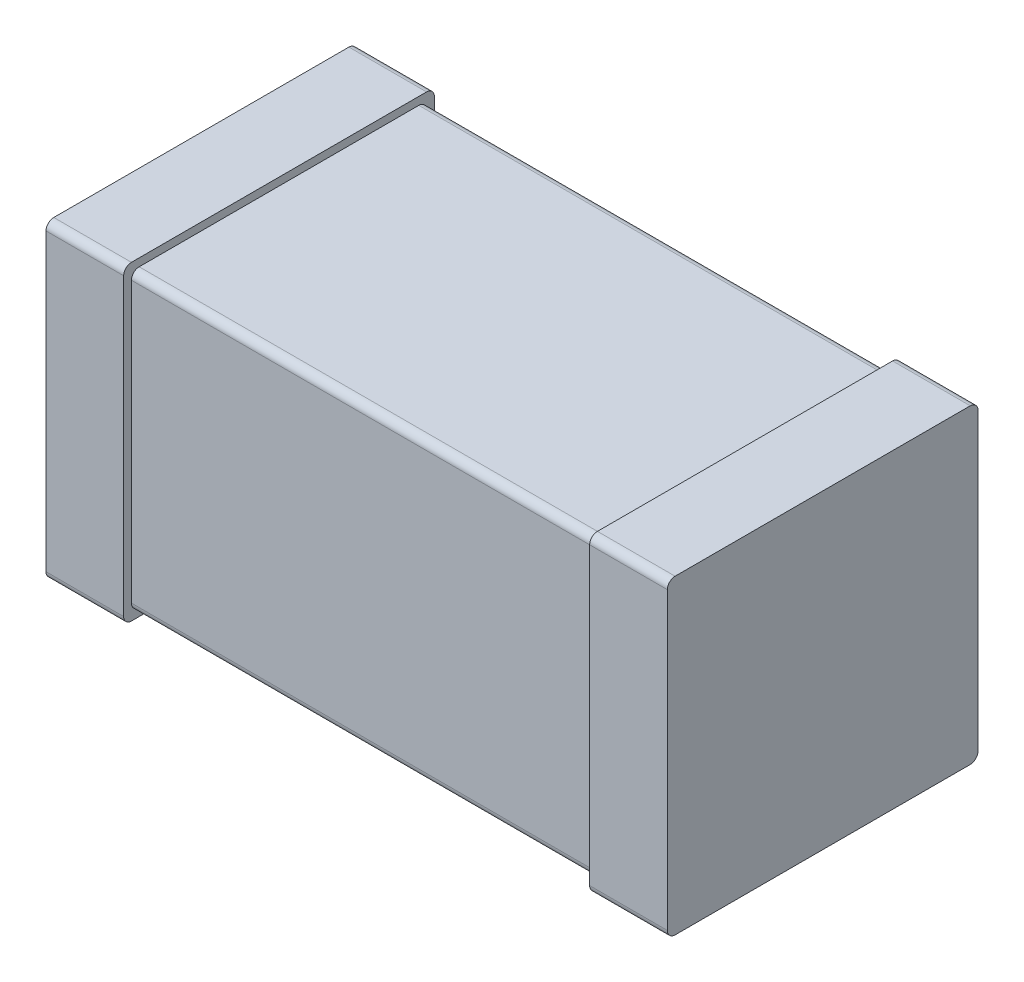
ISO-10303-21;
HEADER;
FILE_DESCRIPTION(('STEP AP214'),'2;1');
FILE_NAME('part.step','',(''),(''),'','','');
FILE_SCHEMA(('AUTOMOTIVE_DESIGN { 1 0 10303 214 1 1 1 1 }'));
ENDSEC;
DATA;
#1=APPLICATION_CONTEXT('core data for automotive mechanical design processes');
#2=APPLICATION_PROTOCOL_DEFINITION('international standard','automotive_design',2000,#1);
#3=PRODUCT_CONTEXT('',#1,'mechanical');
#4=PRODUCT('Part','Part','',(#3));
#5=PRODUCT_RELATED_PRODUCT_CATEGORY('part','',(#4));
#6=PRODUCT_DEFINITION_FORMATION('','',#4);
#7=PRODUCT_DEFINITION_CONTEXT('part definition',#1,'design');
#8=PRODUCT_DEFINITION('design','',#6,#7);
#9=PRODUCT_DEFINITION_SHAPE('','',#8);
#10=(LENGTH_UNIT() NAMED_UNIT(*) SI_UNIT(.MILLI.,.METRE.));
#11=(NAMED_UNIT(*) PLANE_ANGLE_UNIT() SI_UNIT($,.RADIAN.));
#12=(NAMED_UNIT(*) SI_UNIT($,.STERADIAN.) SOLID_ANGLE_UNIT());
#13=UNCERTAINTY_MEASURE_WITH_UNIT(LENGTH_MEASURE(1.E-05),#10,'distance_accuracy_value','');
#14=(GEOMETRIC_REPRESENTATION_CONTEXT(3) GLOBAL_UNCERTAINTY_ASSIGNED_CONTEXT((#13)) GLOBAL_UNIT_ASSIGNED_CONTEXT((#10,
#11,#12)) REPRESENTATION_CONTEXT('',''));
#15=CARTESIAN_POINT('',(0.,0.,0.));
#16=DIRECTION('',(0.,0.,1.));
#17=DIRECTION('',(1.,0.,0.));
#18=AXIS2_PLACEMENT_3D('',#15,#16,#17);
#19=CARTESIAN_POINT('',(-1.6,-0.8,0.));
#20=DIRECTION('',(1.,0.,0.));
#21=DIRECTION('',(0.,1.,0.));
#22=AXIS2_PLACEMENT_3D('',#19,#20,#21);
#23=PLANE('',#22);
#24=CARTESIAN_POINT('',(-1.6,-0.76,1.56));
#25=DIRECTION('',(-1.,0.,0.));
#26=DIRECTION('',(0.,0.,1.));
#27=AXIS2_PLACEMENT_3D('',#24,#25,#26);
#28=CIRCLE('',#27,0.04);
#29=CARTESIAN_POINT('',(-1.6,-0.8,1.56));
#30=VERTEX_POINT('',#29);
#31=CARTESIAN_POINT('',(-1.6,-0.76,1.6));
#32=VERTEX_POINT('',#31);
#33=EDGE_CURVE('E11',#30,#32,#28,.T.);
#34=ORIENTED_EDGE('',*,*,#33,.T.);
#35=DIRECTION('',(0.,1.,0.));
#36=VECTOR('',#35,1.);
#37=CARTESIAN_POINT('',(-1.6,-0.8,1.6));
#38=LINE('',#37,#36);
#39=CARTESIAN_POINT('',(-1.6,0.76,1.6));
#40=VERTEX_POINT('',#39);
#41=EDGE_CURVE('E27',#32,#40,#38,.T.);
#42=ORIENTED_EDGE('',*,*,#41,.T.);
#43=CARTESIAN_POINT('',(-1.6,0.76,1.56));
#44=DIRECTION('',(1.,0.,0.));
#45=DIRECTION('',(0.,0.,1.));
#46=AXIS2_PLACEMENT_3D('',#43,#44,#45);
#47=CIRCLE('',#46,0.04);
#48=CARTESIAN_POINT('',(-1.6,0.8,1.56));
#49=VERTEX_POINT('',#48);
#50=EDGE_CURVE('E479',#49,#40,#47,.T.);
#51=ORIENTED_EDGE('',*,*,#50,.F.);
#52=DIRECTION('',(0.,0.,1.));
#53=VECTOR('',#52,1.);
#54=CARTESIAN_POINT('',(-1.6,0.8,0.));
#55=LINE('',#54,#53);
#56=CARTESIAN_POINT('',(-1.6,0.8,0.04));
#57=VERTEX_POINT('',#56);
#58=EDGE_CURVE('E490',#57,#49,#55,.T.);
#59=ORIENTED_EDGE('',*,*,#58,.F.);
#60=CARTESIAN_POINT('',(-1.6,0.76,0.04));
#61=DIRECTION('',(-1.,0.,0.));
#62=DIRECTION('',(0.,0.,1.));
#63=AXIS2_PLACEMENT_3D('',#60,#61,#62);
#64=CIRCLE('',#63,0.04);
#65=CARTESIAN_POINT('',(-1.6,0.76,0.));
#66=VERTEX_POINT('',#65);
#67=EDGE_CURVE('E286',#57,#66,#64,.T.);
#68=ORIENTED_EDGE('',*,*,#67,.T.);
#69=DIRECTION('',(0.,1.,0.));
#70=VECTOR('',#69,1.);
#71=CARTESIAN_POINT('',(-1.6,-0.8,0.));
#72=LINE('',#71,#70);
#73=CARTESIAN_POINT('',(-1.6,-0.76,0.));
#74=VERTEX_POINT('',#73);
#75=EDGE_CURVE('E232',#74,#66,#72,.T.);
#76=ORIENTED_EDGE('',*,*,#75,.F.);
#77=CARTESIAN_POINT('',(-1.6,-0.76,0.04));
#78=DIRECTION('',(1.,0.,0.));
#79=DIRECTION('',(0.,0.,1.));
#80=AXIS2_PLACEMENT_3D('',#77,#78,#79);
#81=CIRCLE('',#80,0.04);
#82=CARTESIAN_POINT('',(-1.6,-0.8,0.04));
#83=VERTEX_POINT('',#82);
#84=EDGE_CURVE('E179',#83,#74,#81,.T.);
#85=ORIENTED_EDGE('',*,*,#84,.F.);
#86=DIRECTION('',(0.,0.,1.));
#87=VECTOR('',#86,1.);
#88=CARTESIAN_POINT('',(-1.6,-0.8,0.));
#89=LINE('',#88,#87);
#90=EDGE_CURVE('E235',#83,#30,#89,.T.);
#91=ORIENTED_EDGE('',*,*,#90,.T.);
#92=EDGE_LOOP('',(#34,#42,#51,#59,#68,#76,#85,#91));
#93=FACE_BOUND('',#92,.T.);
#94=ADVANCED_FACE('F16',(#93),#23,.F.);
#95=CARTESIAN_POINT('',(-1.6,-0.8,0.));
#96=DIRECTION('',(0.,1.,0.));
#97=DIRECTION('',(1.,0.,0.));
#98=AXIS2_PLACEMENT_3D('',#95,#96,#97);
#99=PLANE('',#98);
#100=DIRECTION('',(1.,0.,0.));
#101=VECTOR('',#100,1.);
#102=CARTESIAN_POINT('',(-1.6,-0.8,1.56));
#103=LINE('',#102,#101);
#104=CARTESIAN_POINT('',(-1.2,-0.8,1.56));
#105=VERTEX_POINT('',#104);
#106=EDGE_CURVE('E182',#30,#105,#103,.T.);
#107=ORIENTED_EDGE('',*,*,#106,.F.);
#108=ORIENTED_EDGE('',*,*,#90,.F.);
#109=DIRECTION('',(1.,0.,0.));
#110=VECTOR('',#109,1.);
#111=CARTESIAN_POINT('',(-1.6,-0.8,0.04));
#112=LINE('',#111,#110);
#113=CARTESIAN_POINT('',(-1.2,-0.8,0.04));
#114=VERTEX_POINT('',#113);
#115=EDGE_CURVE('E233',#83,#114,#112,.T.);
#116=ORIENTED_EDGE('',*,*,#115,.T.);
#117=DIRECTION('',(0.,0.,1.));
#118=VECTOR('',#117,1.);
#119=CARTESIAN_POINT('',(-1.2,-0.8,0.));
#120=LINE('',#119,#118);
#121=EDGE_CURVE('E167',#114,#105,#120,.T.);
#122=ORIENTED_EDGE('',*,*,#121,.T.);
#123=EDGE_LOOP('',(#107,#108,#116,#122));
#124=FACE_BOUND('',#123,.T.);
#125=ADVANCED_FACE('F544',(#124),#99,.F.);
#126=CARTESIAN_POINT('',(-1.6,-0.76,0.04));
#127=DIRECTION('',(1.,0.,0.));
#128=DIRECTION('',(0.,-1.,0.));
#129=AXIS2_PLACEMENT_3D('',#126,#127,#128);
#130=CYLINDRICAL_SURFACE('',#129,0.04);
#131=ORIENTED_EDGE('',*,*,#84,.T.);
#132=DIRECTION('',(1.,0.,0.));
#133=VECTOR('',#132,1.);
#134=CARTESIAN_POINT('',(-1.6,-0.76,0.));
#135=LINE('',#134,#133);
#136=CARTESIAN_POINT('',(-1.2,-0.76,0.));
#137=VERTEX_POINT('',#136);
#138=EDGE_CURVE('E176',#74,#137,#135,.T.);
#139=ORIENTED_EDGE('',*,*,#138,.T.);
#140=CARTESIAN_POINT('',(-1.2,-0.76,0.04));
#141=DIRECTION('',(1.,0.,0.));
#142=DIRECTION('',(0.,0.,1.));
#143=AXIS2_PLACEMENT_3D('',#140,#141,#142);
#144=CIRCLE('',#143,0.04);
#145=EDGE_CURVE('E158',#114,#137,#144,.T.);
#146=ORIENTED_EDGE('',*,*,#145,.F.);
#147=ORIENTED_EDGE('',*,*,#115,.F.);
#148=EDGE_LOOP('',(#131,#139,#146,#147));
#149=FACE_BOUND('',#148,.T.);
#150=ADVANCED_FACE('F177',(#149),#130,.T.);
#151=CARTESIAN_POINT('',(-1.6,-0.76,1.56));
#152=DIRECTION('',(1.,0.,0.));
#153=DIRECTION('',(0.,-1.,0.));
#154=AXIS2_PLACEMENT_3D('',#151,#152,#153);
#155=CYLINDRICAL_SURFACE('',#154,0.04);
#156=ORIENTED_EDGE('',*,*,#106,.T.);
#157=CARTESIAN_POINT('',(-1.2,-0.76,1.56));
#158=DIRECTION('',(-1.,0.,0.));
#159=DIRECTION('',(0.,0.,1.));
#160=AXIS2_PLACEMENT_3D('',#157,#158,#159);
#161=CIRCLE('',#160,0.04);
#162=CARTESIAN_POINT('',(-1.2,-0.76,1.6));
#163=VERTEX_POINT('',#162);
#164=EDGE_CURVE('E248',#105,#163,#161,.T.);
#165=ORIENTED_EDGE('',*,*,#164,.T.);
#166=DIRECTION('',(1.,0.,0.));
#167=VECTOR('',#166,1.);
#168=CARTESIAN_POINT('',(-1.6,-0.76,1.6));
#169=LINE('',#168,#167);
#170=EDGE_CURVE('E229',#32,#163,#169,.T.);
#171=ORIENTED_EDGE('',*,*,#170,.F.);
#172=ORIENTED_EDGE('',*,*,#33,.F.);
#173=EDGE_LOOP('',(#156,#165,#171,#172));
#174=FACE_BOUND('',#173,.T.);
#175=ADVANCED_FACE('F569',(#174),#155,.T.);
#176=CARTESIAN_POINT('',(-1.6,-0.8,0.));
#177=DIRECTION('',(0.,0.,1.));
#178=DIRECTION('',(1.,0.,0.));
#179=AXIS2_PLACEMENT_3D('',#176,#177,#178);
#180=PLANE('',#179);
#181=DIRECTION('',(1.,0.,0.));
#182=VECTOR('',#181,1.);
#183=CARTESIAN_POINT('',(-1.6,0.76,0.));
#184=LINE('',#183,#182);
#185=CARTESIAN_POINT('',(-1.2,0.76,0.));
#186=VERTEX_POINT('',#185);
#187=EDGE_CURVE('E186',#66,#186,#184,.T.);
#188=ORIENTED_EDGE('',*,*,#187,.T.);
#189=DIRECTION('',(0.,1.,0.));
#190=VECTOR('',#189,1.);
#191=CARTESIAN_POINT('',(-1.2,-0.8,0.));
#192=LINE('',#191,#190);
#193=EDGE_CURVE('E163',#137,#186,#192,.T.);
#194=ORIENTED_EDGE('',*,*,#193,.F.);
#195=ORIENTED_EDGE('',*,*,#138,.F.);
#196=ORIENTED_EDGE('',*,*,#75,.T.);
#197=EDGE_LOOP('',(#188,#194,#195,#196));
#198=FACE_BOUND('',#197,.T.);
#199=ADVANCED_FACE('F184',(#198),#180,.F.);
#200=CARTESIAN_POINT('',(-1.6,-0.8,1.6));
#201=DIRECTION('',(0.,0.,1.));
#202=DIRECTION('',(1.,0.,0.));
#203=AXIS2_PLACEMENT_3D('',#200,#201,#202);
#204=PLANE('',#203);
#205=ORIENTED_EDGE('',*,*,#41,.F.);
#206=ORIENTED_EDGE('',*,*,#170,.T.);
#207=DIRECTION('',(0.,1.,0.));
#208=VECTOR('',#207,1.);
#209=CARTESIAN_POINT('',(-1.2,-0.8,1.6));
#210=LINE('',#209,#208);
#211=CARTESIAN_POINT('',(-1.2,0.76,1.6));
#212=VERTEX_POINT('',#211);
#213=EDGE_CURVE('E204',#163,#212,#210,.T.);
#214=ORIENTED_EDGE('',*,*,#213,.T.);
#215=DIRECTION('',(1.,0.,0.));
#216=VECTOR('',#215,1.);
#217=CARTESIAN_POINT('',(-1.6,0.76,1.6));
#218=LINE('',#217,#216);
#219=EDGE_CURVE('E482',#40,#212,#218,.T.);
#220=ORIENTED_EDGE('',*,*,#219,.F.);
#221=EDGE_LOOP('',(#205,#206,#214,#220));
#222=FACE_BOUND('',#221,.T.);
#223=ADVANCED_FACE('F784',(#222),#204,.T.);
#224=CARTESIAN_POINT('',(-1.6,0.76,0.04));
#225=DIRECTION('',(1.,0.,0.));
#226=DIRECTION('',(0.,1.,0.));
#227=AXIS2_PLACEMENT_3D('',#224,#225,#226);
#228=CYLINDRICAL_SURFACE('',#227,0.04);
#229=DIRECTION('',(1.,0.,0.));
#230=VECTOR('',#229,1.);
#231=CARTESIAN_POINT('',(-1.6,0.8,0.04));
#232=LINE('',#231,#230);
#233=CARTESIAN_POINT('',(-1.2,0.8,0.04));
#234=VERTEX_POINT('',#233);
#235=EDGE_CURVE('E201',#57,#234,#232,.T.);
#236=ORIENTED_EDGE('',*,*,#235,.T.);
#237=CARTESIAN_POINT('',(-1.2,0.76,0.04));
#238=DIRECTION('',(-1.,0.,0.));
#239=DIRECTION('',(0.,0.,1.));
#240=AXIS2_PLACEMENT_3D('',#237,#238,#239);
#241=CIRCLE('',#240,0.04);
#242=EDGE_CURVE('E205',#234,#186,#241,.T.);
#243=ORIENTED_EDGE('',*,*,#242,.T.);
#244=ORIENTED_EDGE('',*,*,#187,.F.);
#245=ORIENTED_EDGE('',*,*,#67,.F.);
#246=EDGE_LOOP('',(#236,#243,#244,#245));
#247=FACE_BOUND('',#246,.T.);
#248=ADVANCED_FACE('F791',(#247),#228,.T.);
#249=CARTESIAN_POINT('',(-1.6,0.76,1.56));
#250=DIRECTION('',(1.,0.,0.));
#251=DIRECTION('',(0.,1.,0.));
#252=AXIS2_PLACEMENT_3D('',#249,#250,#251);
#253=CYLINDRICAL_SURFACE('',#252,0.04);
#254=ORIENTED_EDGE('',*,*,#50,.T.);
#255=ORIENTED_EDGE('',*,*,#219,.T.);
#256=CARTESIAN_POINT('',(-1.2,0.76,1.56));
#257=DIRECTION('',(1.,0.,0.));
#258=DIRECTION('',(0.,0.,1.));
#259=AXIS2_PLACEMENT_3D('',#256,#257,#258);
#260=CIRCLE('',#259,0.04);
#261=CARTESIAN_POINT('',(-1.2,0.8,1.56));
#262=VERTEX_POINT('',#261);
#263=EDGE_CURVE('E196',#262,#212,#260,.T.);
#264=ORIENTED_EDGE('',*,*,#263,.F.);
#265=DIRECTION('',(1.,0.,0.));
#266=VECTOR('',#265,1.);
#267=CARTESIAN_POINT('',(-1.6,0.8,1.56));
#268=LINE('',#267,#266);
#269=EDGE_CURVE('E172',#49,#262,#268,.T.);
#270=ORIENTED_EDGE('',*,*,#269,.F.);
#271=EDGE_LOOP('',(#254,#255,#264,#270));
#272=FACE_BOUND('',#271,.T.);
#273=ADVANCED_FACE('F799',(#272),#253,.T.);
#274=CARTESIAN_POINT('',(-1.6,0.8,0.));
#275=DIRECTION('',(0.,1.,0.));
#276=DIRECTION('',(1.,0.,0.));
#277=AXIS2_PLACEMENT_3D('',#274,#275,#276);
#278=PLANE('',#277);
#279=DIRECTION('',(0.,0.,1.));
#280=VECTOR('',#279,1.);
#281=CARTESIAN_POINT('',(-1.2,0.8,0.));
#282=LINE('',#281,#280);
#283=EDGE_CURVE('E189',#234,#262,#282,.T.);
#284=ORIENTED_EDGE('',*,*,#283,.F.);
#285=ORIENTED_EDGE('',*,*,#235,.F.);
#286=ORIENTED_EDGE('',*,*,#58,.T.);
#287=ORIENTED_EDGE('',*,*,#269,.T.);
#288=EDGE_LOOP('',(#284,#285,#286,#287));
#289=FACE_BOUND('',#288,.T.);
#290=ADVANCED_FACE('F807',(#289),#278,.T.);
#291=CARTESIAN_POINT('',(-1.2,-0.8,0.));
#292=DIRECTION('',(1.,0.,0.));
#293=DIRECTION('',(0.,1.,0.));
#294=AXIS2_PLACEMENT_3D('',#291,#292,#293);
#295=PLANE('',#294);
#296=ORIENTED_EDGE('',*,*,#121,.F.);
#297=ORIENTED_EDGE('',*,*,#145,.T.);
#298=ORIENTED_EDGE('',*,*,#193,.T.);
#299=ORIENTED_EDGE('',*,*,#242,.F.);
#300=ORIENTED_EDGE('',*,*,#283,.T.);
#301=ORIENTED_EDGE('',*,*,#263,.T.);
#302=ORIENTED_EDGE('',*,*,#213,.F.);
#303=ORIENTED_EDGE('',*,*,#164,.F.);
#304=EDGE_LOOP('',(#296,#297,#298,#299,#300,#301,#302,#303));
#305=FACE_BOUND('',#304,.T.);
#306=CARTESIAN_POINT('',(-1.2,-0.72,0.08));
#307=DIRECTION('',(1.,0.,0.));
#308=DIRECTION('',(0.,0.,1.));
#309=AXIS2_PLACEMENT_3D('',#306,#307,#308);
#310=CIRCLE('',#309,0.04);
#311=CARTESIAN_POINT('',(-1.2,-0.76,0.08));
#312=VERTEX_POINT('',#311);
#313=CARTESIAN_POINT('',(-1.2,-0.72,0.04));
#314=VERTEX_POINT('',#313);
#315=EDGE_CURVE('E252',#312,#314,#310,.T.);
#316=ORIENTED_EDGE('',*,*,#315,.F.);
#317=DIRECTION('',(0.,0.,1.));
#318=VECTOR('',#317,1.);
#319=CARTESIAN_POINT('',(-1.2,-0.76,0.04));
#320=LINE('',#319,#318);
#321=CARTESIAN_POINT('',(-1.2,-0.76,1.52));
#322=VERTEX_POINT('',#321);
#323=EDGE_CURVE('E264',#312,#322,#320,.T.);
#324=ORIENTED_EDGE('',*,*,#323,.T.);
#325=CARTESIAN_POINT('',(-1.2,-0.72,1.52));
#326=DIRECTION('',(-1.,0.,0.));
#327=DIRECTION('',(0.,0.,1.));
#328=AXIS2_PLACEMENT_3D('',#325,#326,#327);
#329=CIRCLE('',#328,0.04);
#330=CARTESIAN_POINT('',(-1.2,-0.72,1.56));
#331=VERTEX_POINT('',#330);
#332=EDGE_CURVE('E210',#322,#331,#329,.T.);
#333=ORIENTED_EDGE('',*,*,#332,.T.);
#334=DIRECTION('',(0.,1.,0.));
#335=VECTOR('',#334,1.);
#336=CARTESIAN_POINT('',(-1.2,-0.76,1.56));
#337=LINE('',#336,#335);
#338=CARTESIAN_POINT('',(-1.2,0.72,1.56));
#339=VERTEX_POINT('',#338);
#340=EDGE_CURVE('E206',#331,#339,#337,.T.);
#341=ORIENTED_EDGE('',*,*,#340,.T.);
#342=CARTESIAN_POINT('',(-1.2,0.72,1.52));
#343=DIRECTION('',(1.,0.,0.));
#344=DIRECTION('',(0.,0.,1.));
#345=AXIS2_PLACEMENT_3D('',#342,#343,#344);
#346=CIRCLE('',#345,0.04);
#347=CARTESIAN_POINT('',(-1.2,0.76,1.52));
#348=VERTEX_POINT('',#347);
#349=EDGE_CURVE('E329',#348,#339,#346,.T.);
#350=ORIENTED_EDGE('',*,*,#349,.F.);
#351=DIRECTION('',(0.,0.,1.));
#352=VECTOR('',#351,1.);
#353=CARTESIAN_POINT('',(-1.2,0.76,0.04));
#354=LINE('',#353,#352);
#355=CARTESIAN_POINT('',(-1.2,0.76,0.08));
#356=VERTEX_POINT('',#355);
#357=EDGE_CURVE('E308',#356,#348,#354,.T.);
#358=ORIENTED_EDGE('',*,*,#357,.F.);
#359=CARTESIAN_POINT('',(-1.2,0.72,0.08));
#360=DIRECTION('',(-1.,0.,0.));
#361=DIRECTION('',(0.,0.,1.));
#362=AXIS2_PLACEMENT_3D('',#359,#360,#361);
#363=CIRCLE('',#362,0.04);
#364=CARTESIAN_POINT('',(-1.2,0.72,0.04));
#365=VERTEX_POINT('',#364);
#366=EDGE_CURVE('E211',#356,#365,#363,.T.);
#367=ORIENTED_EDGE('',*,*,#366,.T.);
#368=DIRECTION('',(0.,1.,0.));
#369=VECTOR('',#368,1.);
#370=CARTESIAN_POINT('',(-1.2,-0.76,0.04));
#371=LINE('',#370,#369);
#372=EDGE_CURVE('E245',#314,#365,#371,.T.);
#373=ORIENTED_EDGE('',*,*,#372,.F.);
#374=EDGE_LOOP('',(#316,#324,#333,#341,#350,#358,#367,#373));
#375=FACE_BOUND('',#374,.T.);
#376=ADVANCED_FACE('F160',(#305,#375),#295,.T.);
#377=CARTESIAN_POINT('',(-1.2,-0.72,0.08));
#378=DIRECTION('',(1.,0.,0.));
#379=DIRECTION('',(0.,-1.,0.));
#380=AXIS2_PLACEMENT_3D('',#377,#378,#379);
#381=CYLINDRICAL_SURFACE('',#380,0.04);
#382=ORIENTED_EDGE('',*,*,#315,.T.);
#383=DIRECTION('',(1.,0.,0.));
#384=VECTOR('',#383,1.);
#385=CARTESIAN_POINT('',(-1.2,-0.72,0.04));
#386=LINE('',#385,#384);
#387=CARTESIAN_POINT('',(1.2,-0.72,0.04));
#388=VERTEX_POINT('',#387);
#389=EDGE_CURVE('E244',#314,#388,#386,.T.);
#390=ORIENTED_EDGE('',*,*,#389,.T.);
#391=CARTESIAN_POINT('',(1.2,-0.72,0.08));
#392=DIRECTION('',(1.,0.,0.));
#393=DIRECTION('',(0.,0.,1.));
#394=AXIS2_PLACEMENT_3D('',#391,#392,#393);
#395=CIRCLE('',#394,0.04);
#396=CARTESIAN_POINT('',(1.2,-0.76,0.08));
#397=VERTEX_POINT('',#396);
#398=EDGE_CURVE('E281',#397,#388,#395,.T.);
#399=ORIENTED_EDGE('',*,*,#398,.F.);
#400=DIRECTION('',(1.,0.,0.));
#401=VECTOR('',#400,1.);
#402=CARTESIAN_POINT('',(-1.2,-0.76,0.08));
#403=LINE('',#402,#401);
#404=EDGE_CURVE('E276',#312,#397,#403,.T.);
#405=ORIENTED_EDGE('',*,*,#404,.F.);
#406=EDGE_LOOP('',(#382,#390,#399,#405));
#407=FACE_BOUND('',#406,.T.);
#408=ADVANCED_FACE('F18',(#407),#381,.T.);
#409=CARTESIAN_POINT('',(-1.2,-0.76,0.04));
#410=DIRECTION('',(0.,0.,1.));
#411=DIRECTION('',(1.,0.,0.));
#412=AXIS2_PLACEMENT_3D('',#409,#410,#411);
#413=PLANE('',#412);
#414=DIRECTION('',(1.,0.,0.));
#415=VECTOR('',#414,1.);
#416=CARTESIAN_POINT('',(-1.2,0.72,0.04));
#417=LINE('',#416,#415);
#418=CARTESIAN_POINT('',(1.2,0.72,0.04));
#419=VERTEX_POINT('',#418);
#420=EDGE_CURVE('E240',#365,#419,#417,.T.);
#421=ORIENTED_EDGE('',*,*,#420,.T.);
#422=DIRECTION('',(0.,1.,0.));
#423=VECTOR('',#422,1.);
#424=CARTESIAN_POINT('',(1.2,-0.76,0.04));
#425=LINE('',#424,#423);
#426=EDGE_CURVE('E215',#388,#419,#425,.T.);
#427=ORIENTED_EDGE('',*,*,#426,.F.);
#428=ORIENTED_EDGE('',*,*,#389,.F.);
#429=ORIENTED_EDGE('',*,*,#372,.T.);
#430=EDGE_LOOP('',(#421,#427,#428,#429));
#431=FACE_BOUND('',#430,.T.);
#432=ADVANCED_FACE('F555',(#431),#413,.F.);
#433=CARTESIAN_POINT('',(-1.2,0.72,0.08));
#434=DIRECTION('',(1.,0.,0.));
#435=DIRECTION('',(0.,1.,0.));
#436=AXIS2_PLACEMENT_3D('',#433,#434,#435);
#437=CYLINDRICAL_SURFACE('',#436,0.04);
#438=DIRECTION('',(1.,0.,0.));
#439=VECTOR('',#438,1.);
#440=CARTESIAN_POINT('',(-1.2,0.76,0.08));
#441=LINE('',#440,#439);
#442=CARTESIAN_POINT('',(1.2,0.76,0.08));
#443=VERTEX_POINT('',#442);
#444=EDGE_CURVE('E307',#356,#443,#441,.T.);
#445=ORIENTED_EDGE('',*,*,#444,.T.);
#446=CARTESIAN_POINT('',(1.2,0.72,0.08));
#447=DIRECTION('',(-1.,0.,0.));
#448=DIRECTION('',(0.,0.,1.));
#449=AXIS2_PLACEMENT_3D('',#446,#447,#448);
#450=CIRCLE('',#449,0.04);
#451=EDGE_CURVE('E303',#443,#419,#450,.T.);
#452=ORIENTED_EDGE('',*,*,#451,.T.);
#453=ORIENTED_EDGE('',*,*,#420,.F.);
#454=ORIENTED_EDGE('',*,*,#366,.F.);
#455=EDGE_LOOP('',(#445,#452,#453,#454));
#456=FACE_BOUND('',#455,.T.);
#457=ADVANCED_FACE('F558',(#456),#437,.T.);
#458=CARTESIAN_POINT('',(-1.2,0.76,0.04));
#459=DIRECTION('',(0.,1.,0.));
#460=DIRECTION('',(1.,0.,0.));
#461=AXIS2_PLACEMENT_3D('',#458,#459,#460);
#462=PLANE('',#461);
#463=DIRECTION('',(0.,0.,1.));
#464=VECTOR('',#463,1.);
#465=CARTESIAN_POINT('',(1.2,0.76,0.04));
#466=LINE('',#465,#464);
#467=CARTESIAN_POINT('',(1.2,0.76,1.52));
#468=VERTEX_POINT('',#467);
#469=EDGE_CURVE('E212',#443,#468,#466,.T.);
#470=ORIENTED_EDGE('',*,*,#469,.F.);
#471=ORIENTED_EDGE('',*,*,#444,.F.);
#472=ORIENTED_EDGE('',*,*,#357,.T.);
#473=DIRECTION('',(1.,0.,0.));
#474=VECTOR('',#473,1.);
#475=CARTESIAN_POINT('',(-1.2,0.76,1.52));
#476=LINE('',#475,#474);
#477=EDGE_CURVE('E338',#348,#468,#476,.T.);
#478=ORIENTED_EDGE('',*,*,#477,.T.);
#479=EDGE_LOOP('',(#470,#471,#472,#478));
#480=FACE_BOUND('',#479,.T.);
#481=ADVANCED_FACE('F560',(#480),#462,.T.);
#482=CARTESIAN_POINT('',(-1.2,0.72,1.52));
#483=DIRECTION('',(1.,0.,0.));
#484=DIRECTION('',(0.,1.,0.));
#485=AXIS2_PLACEMENT_3D('',#482,#483,#484);
#486=CYLINDRICAL_SURFACE('',#485,0.04);
#487=ORIENTED_EDGE('',*,*,#349,.T.);
#488=DIRECTION('',(1.,0.,0.));
#489=VECTOR('',#488,1.);
#490=CARTESIAN_POINT('',(-1.2,0.72,1.56));
#491=LINE('',#490,#489);
#492=CARTESIAN_POINT('',(1.2,0.72,1.56));
#493=VERTEX_POINT('',#492);
#494=EDGE_CURVE('E325',#339,#493,#491,.T.);
#495=ORIENTED_EDGE('',*,*,#494,.T.);
#496=CARTESIAN_POINT('',(1.2,0.72,1.52));
#497=DIRECTION('',(1.,0.,0.));
#498=DIRECTION('',(0.,0.,1.));
#499=AXIS2_PLACEMENT_3D('',#496,#497,#498);
#500=CIRCLE('',#499,0.04);
#501=EDGE_CURVE('E216',#468,#493,#500,.T.);
#502=ORIENTED_EDGE('',*,*,#501,.F.);
#503=ORIENTED_EDGE('',*,*,#477,.F.);
#504=EDGE_LOOP('',(#487,#495,#502,#503));
#505=FACE_BOUND('',#504,.T.);
#506=ADVANCED_FACE('F379',(#505),#486,.T.);
#507=CARTESIAN_POINT('',(-1.2,-0.76,1.56));
#508=DIRECTION('',(0.,0.,1.));
#509=DIRECTION('',(1.,0.,0.));
#510=AXIS2_PLACEMENT_3D('',#507,#508,#509);
#511=PLANE('',#510);
#512=ORIENTED_EDGE('',*,*,#340,.F.);
#513=DIRECTION('',(1.,0.,0.));
#514=VECTOR('',#513,1.);
#515=CARTESIAN_POINT('',(-1.2,-0.72,1.56));
#516=LINE('',#515,#514);
#517=CARTESIAN_POINT('',(1.2,-0.72,1.56));
#518=VERTEX_POINT('',#517);
#519=EDGE_CURVE('E330',#331,#518,#516,.T.);
#520=ORIENTED_EDGE('',*,*,#519,.T.);
#521=DIRECTION('',(0.,1.,0.));
#522=VECTOR('',#521,1.);
#523=CARTESIAN_POINT('',(1.2,-0.76,1.56));
#524=LINE('',#523,#522);
#525=EDGE_CURVE('E271',#518,#493,#524,.T.);
#526=ORIENTED_EDGE('',*,*,#525,.T.);
#527=ORIENTED_EDGE('',*,*,#494,.F.);
#528=EDGE_LOOP('',(#512,#520,#526,#527));
#529=FACE_BOUND('',#528,.T.);
#530=ADVANCED_FACE('F358',(#529),#511,.T.);
#531=CARTESIAN_POINT('',(-1.2,-0.72,1.52));
#532=DIRECTION('',(1.,0.,0.));
#533=DIRECTION('',(0.,-1.,0.));
#534=AXIS2_PLACEMENT_3D('',#531,#532,#533);
#535=CYLINDRICAL_SURFACE('',#534,0.04);
#536=DIRECTION('',(1.,0.,0.));
#537=VECTOR('',#536,1.);
#538=CARTESIAN_POINT('',(-1.2,-0.76,1.52));
#539=LINE('',#538,#537);
#540=CARTESIAN_POINT('',(1.2,-0.76,1.52));
#541=VERTEX_POINT('',#540);
#542=EDGE_CURVE('E267',#322,#541,#539,.T.);
#543=ORIENTED_EDGE('',*,*,#542,.T.);
#544=CARTESIAN_POINT('',(1.2,-0.72,1.52));
#545=DIRECTION('',(-1.,0.,0.));
#546=DIRECTION('',(0.,0.,1.));
#547=AXIS2_PLACEMENT_3D('',#544,#545,#546);
#548=CIRCLE('',#547,0.04);
#549=EDGE_CURVE('E272',#541,#518,#548,.T.);
#550=ORIENTED_EDGE('',*,*,#549,.T.);
#551=ORIENTED_EDGE('',*,*,#519,.F.);
#552=ORIENTED_EDGE('',*,*,#332,.F.);
#553=EDGE_LOOP('',(#543,#550,#551,#552));
#554=FACE_BOUND('',#553,.T.);
#555=ADVANCED_FACE('F364',(#554),#535,.T.);
#556=CARTESIAN_POINT('',(-1.2,-0.76,0.04));
#557=DIRECTION('',(0.,1.,0.));
#558=DIRECTION('',(1.,0.,0.));
#559=AXIS2_PLACEMENT_3D('',#556,#557,#558);
#560=PLANE('',#559);
#561=ORIENTED_EDGE('',*,*,#542,.F.);
#562=ORIENTED_EDGE('',*,*,#323,.F.);
#563=ORIENTED_EDGE('',*,*,#404,.T.);
#564=DIRECTION('',(0.,0.,1.));
#565=VECTOR('',#564,1.);
#566=CARTESIAN_POINT('',(1.2,-0.76,0.04));
#567=LINE('',#566,#565);
#568=EDGE_CURVE('E296',#397,#541,#567,.T.);
#569=ORIENTED_EDGE('',*,*,#568,.T.);
#570=EDGE_LOOP('',(#561,#562,#563,#569));
#571=FACE_BOUND('',#570,.T.);
#572=ADVANCED_FACE('F567',(#571),#560,.F.);
#573=CARTESIAN_POINT('',(1.2,-0.8,0.));
#574=DIRECTION('',(1.,0.,0.));
#575=DIRECTION('',(0.,1.,0.));
#576=AXIS2_PLACEMENT_3D('',#573,#574,#575);
#577=PLANE('',#576);
#578=CARTESIAN_POINT('',(1.2,-0.76,1.56));
#579=DIRECTION('',(-1.,0.,0.));
#580=DIRECTION('',(0.,0.,1.));
#581=AXIS2_PLACEMENT_3D('',#578,#579,#580);
#582=CIRCLE('',#581,0.04);
#583=CARTESIAN_POINT('',(1.2,-0.8,1.56));
#584=VERTEX_POINT('',#583);
#585=CARTESIAN_POINT('',(1.2,-0.76,1.6));
#586=VERTEX_POINT('',#585);
#587=EDGE_CURVE('E293',#584,#586,#582,.T.);
#588=ORIENTED_EDGE('',*,*,#587,.T.);
#589=DIRECTION('',(0.,1.,0.));
#590=VECTOR('',#589,1.);
#591=CARTESIAN_POINT('',(1.2,-0.8,1.6));
#592=LINE('',#591,#590);
#593=CARTESIAN_POINT('',(1.2,0.76,1.6));
#594=VERTEX_POINT('',#593);
#595=EDGE_CURVE('E120',#586,#594,#592,.T.);
#596=ORIENTED_EDGE('',*,*,#595,.T.);
#597=CARTESIAN_POINT('',(1.2,0.76,1.56));
#598=DIRECTION('',(1.,0.,0.));
#599=DIRECTION('',(0.,0.,1.));
#600=AXIS2_PLACEMENT_3D('',#597,#598,#599);
#601=CIRCLE('',#600,0.04);
#602=CARTESIAN_POINT('',(1.2,0.8,1.56));
#603=VERTEX_POINT('',#602);
#604=EDGE_CURVE('E108',#603,#594,#601,.T.);
#605=ORIENTED_EDGE('',*,*,#604,.F.);
#606=DIRECTION('',(0.,0.,1.));
#607=VECTOR('',#606,1.);
#608=CARTESIAN_POINT('',(1.2,0.8,0.));
#609=LINE('',#608,#607);
#610=CARTESIAN_POINT('',(1.2,0.8,0.04));
#611=VERTEX_POINT('',#610);
#612=EDGE_CURVE('E221',#611,#603,#609,.T.);
#613=ORIENTED_EDGE('',*,*,#612,.F.);
#614=CARTESIAN_POINT('',(1.2,0.76,0.04));
#615=DIRECTION('',(-1.,0.,0.));
#616=DIRECTION('',(0.,0.,1.));
#617=AXIS2_PLACEMENT_3D('',#614,#615,#616);
#618=CIRCLE('',#617,0.04);
#619=CARTESIAN_POINT('',(1.2,0.76,0.));
#620=VERTEX_POINT('',#619);
#621=EDGE_CURVE('E309',#611,#620,#618,.T.);
#622=ORIENTED_EDGE('',*,*,#621,.T.);
#623=DIRECTION('',(0.,1.,0.));
#624=VECTOR('',#623,1.);
#625=CARTESIAN_POINT('',(1.2,-0.8,0.));
#626=LINE('',#625,#624);
#627=CARTESIAN_POINT('',(1.2,-0.76,0.));
#628=VERTEX_POINT('',#627);
#629=EDGE_CURVE('E260',#628,#620,#626,.T.);
#630=ORIENTED_EDGE('',*,*,#629,.F.);
#631=CARTESIAN_POINT('',(1.2,-0.76,0.04));
#632=DIRECTION('',(1.,0.,0.));
#633=DIRECTION('',(0.,0.,1.));
#634=AXIS2_PLACEMENT_3D('',#631,#632,#633);
#635=CIRCLE('',#634,0.04);
#636=CARTESIAN_POINT('',(1.2,-0.8,0.04));
#637=VERTEX_POINT('',#636);
#638=EDGE_CURVE('E292',#637,#628,#635,.T.);
#639=ORIENTED_EDGE('',*,*,#638,.F.);
#640=DIRECTION('',(0.,0.,1.));
#641=VECTOR('',#640,1.);
#642=CARTESIAN_POINT('',(1.2,-0.8,0.));
#643=LINE('',#642,#641);
#644=EDGE_CURVE('E313',#637,#584,#643,.T.);
#645=ORIENTED_EDGE('',*,*,#644,.T.);
#646=EDGE_LOOP('',(#588,#596,#605,#613,#622,#630,#639,#645));
#647=FACE_BOUND('',#646,.T.);
#648=ORIENTED_EDGE('',*,*,#426,.T.);
#649=ORIENTED_EDGE('',*,*,#451,.F.);
#650=ORIENTED_EDGE('',*,*,#469,.T.);
#651=ORIENTED_EDGE('',*,*,#501,.T.);
#652=ORIENTED_EDGE('',*,*,#525,.F.);
#653=ORIENTED_EDGE('',*,*,#549,.F.);
#654=ORIENTED_EDGE('',*,*,#568,.F.);
#655=ORIENTED_EDGE('',*,*,#398,.T.);
#656=EDGE_LOOP('',(#648,#649,#650,#651,#652,#653,#654,#655));
#657=FACE_BOUND('',#656,.T.);
#658=ADVANCED_FACE('F370',(#647,#657),#577,.F.);
#659=CARTESIAN_POINT('',(1.2,-0.8,0.));
#660=DIRECTION('',(0.,1.,0.));
#661=DIRECTION('',(1.,0.,0.));
#662=AXIS2_PLACEMENT_3D('',#659,#660,#661);
#663=PLANE('',#662);
#664=DIRECTION('',(1.,0.,0.));
#665=VECTOR('',#664,1.);
#666=CARTESIAN_POINT('',(1.2,-0.8,1.56));
#667=LINE('',#666,#665);
#668=CARTESIAN_POINT('',(1.6,-0.8,1.56));
#669=VERTEX_POINT('',#668);
#670=EDGE_CURVE('E478',#584,#669,#667,.T.);
#671=ORIENTED_EDGE('',*,*,#670,.F.);
#672=ORIENTED_EDGE('',*,*,#644,.F.);
#673=DIRECTION('',(1.,0.,0.));
#674=VECTOR('',#673,1.);
#675=CARTESIAN_POINT('',(1.2,-0.8,0.04));
#676=LINE('',#675,#674);
#677=CARTESIAN_POINT('',(1.6,-0.8,0.04));
#678=VERTEX_POINT('',#677);
#679=EDGE_CURVE('E277',#637,#678,#676,.T.);
#680=ORIENTED_EDGE('',*,*,#679,.T.);
#681=DIRECTION('',(0.,0.,1.));
#682=VECTOR('',#681,1.);
#683=CARTESIAN_POINT('',(1.6,-0.8,0.));
#684=LINE('',#683,#682);
#685=EDGE_CURVE('E282',#678,#669,#684,.T.);
#686=ORIENTED_EDGE('',*,*,#685,.T.);
#687=EDGE_LOOP('',(#671,#672,#680,#686));
#688=FACE_BOUND('',#687,.T.);
#689=ADVANCED_FACE('F566',(#688),#663,.F.);
#690=CARTESIAN_POINT('',(1.2,-0.76,0.04));
#691=DIRECTION('',(1.,0.,0.));
#692=DIRECTION('',(0.,-1.,0.));
#693=AXIS2_PLACEMENT_3D('',#690,#691,#692);
#694=CYLINDRICAL_SURFACE('',#693,0.04);
#695=ORIENTED_EDGE('',*,*,#638,.T.);
#696=DIRECTION('',(1.,0.,0.));
#697=VECTOR('',#696,1.);
#698=CARTESIAN_POINT('',(1.2,-0.76,0.));
#699=LINE('',#698,#697);
#700=CARTESIAN_POINT('',(1.6,-0.76,0.));
#701=VERTEX_POINT('',#700);
#702=EDGE_CURVE('E513',#628,#701,#699,.T.);
#703=ORIENTED_EDGE('',*,*,#702,.T.);
#704=CARTESIAN_POINT('',(1.6,-0.76,0.04));
#705=DIRECTION('',(1.,0.,0.));
#706=DIRECTION('',(0.,0.,1.));
#707=AXIS2_PLACEMENT_3D('',#704,#705,#706);
#708=CIRCLE('',#707,0.04);
#709=EDGE_CURVE('E222',#678,#701,#708,.T.);
#710=ORIENTED_EDGE('',*,*,#709,.F.);
#711=ORIENTED_EDGE('',*,*,#679,.F.);
#712=EDGE_LOOP('',(#695,#703,#710,#711));
#713=FACE_BOUND('',#712,.T.);
#714=ADVANCED_FACE('F704',(#713),#694,.T.);
#715=CARTESIAN_POINT('',(1.2,-0.76,1.56));
#716=DIRECTION('',(1.,0.,0.));
#717=DIRECTION('',(0.,-1.,0.));
#718=AXIS2_PLACEMENT_3D('',#715,#716,#717);
#719=CYLINDRICAL_SURFACE('',#718,0.04);
#720=ORIENTED_EDGE('',*,*,#670,.T.);
#721=CARTESIAN_POINT('',(1.6,-0.76,1.56));
#722=DIRECTION('',(-1.,0.,0.));
#723=DIRECTION('',(0.,0.,1.));
#724=AXIS2_PLACEMENT_3D('',#721,#722,#723);
#725=CIRCLE('',#724,0.04);
#726=CARTESIAN_POINT('',(1.6,-0.76,1.6));
#727=VERTEX_POINT('',#726);
#728=EDGE_CURVE('E259',#669,#727,#725,.T.);
#729=ORIENTED_EDGE('',*,*,#728,.T.);
#730=DIRECTION('',(1.,0.,0.));
#731=VECTOR('',#730,1.);
#732=CARTESIAN_POINT('',(1.2,-0.76,1.6));
#733=LINE('',#732,#731);
#734=EDGE_CURVE('E20',#586,#727,#733,.T.);
#735=ORIENTED_EDGE('',*,*,#734,.F.);
#736=ORIENTED_EDGE('',*,*,#587,.F.);
#737=EDGE_LOOP('',(#720,#729,#735,#736));
#738=FACE_BOUND('',#737,.T.);
#739=ADVANCED_FACE('F713',(#738),#719,.T.);
#740=CARTESIAN_POINT('',(1.2,-0.8,0.));
#741=DIRECTION('',(0.,0.,1.));
#742=DIRECTION('',(1.,0.,0.));
#743=AXIS2_PLACEMENT_3D('',#740,#741,#742);
#744=PLANE('',#743);
#745=DIRECTION('',(1.,0.,0.));
#746=VECTOR('',#745,1.);
#747=CARTESIAN_POINT('',(1.2,0.76,0.));
#748=LINE('',#747,#746);
#749=CARTESIAN_POINT('',(1.6,0.76,0.));
#750=VERTEX_POINT('',#749);
#751=EDGE_CURVE('E255',#620,#750,#748,.T.);
#752=ORIENTED_EDGE('',*,*,#751,.T.);
#753=DIRECTION('',(0.,1.,0.));
#754=VECTOR('',#753,1.);
#755=CARTESIAN_POINT('',(1.6,-0.8,0.));
#756=LINE('',#755,#754);
#757=EDGE_CURVE('E227',#701,#750,#756,.T.);
#758=ORIENTED_EDGE('',*,*,#757,.F.);
#759=ORIENTED_EDGE('',*,*,#702,.F.);
#760=ORIENTED_EDGE('',*,*,#629,.T.);
#761=EDGE_LOOP('',(#752,#758,#759,#760));
#762=FACE_BOUND('',#761,.T.);
#763=ADVANCED_FACE('F722',(#762),#744,.F.);
#764=CARTESIAN_POINT('',(1.2,-0.8,1.6));
#765=DIRECTION('',(0.,0.,1.));
#766=DIRECTION('',(1.,0.,0.));
#767=AXIS2_PLACEMENT_3D('',#764,#765,#766);
#768=PLANE('',#767);
#769=ORIENTED_EDGE('',*,*,#595,.F.);
#770=ORIENTED_EDGE('',*,*,#734,.T.);
#771=DIRECTION('',(0.,1.,0.));
#772=VECTOR('',#771,1.);
#773=CARTESIAN_POINT('',(1.6,-0.8,1.6));
#774=LINE('',#773,#772);
#775=CARTESIAN_POINT('',(1.6,0.76,1.6));
#776=VERTEX_POINT('',#775);
#777=EDGE_CURVE('E314',#727,#776,#774,.T.);
#778=ORIENTED_EDGE('',*,*,#777,.T.);
#779=DIRECTION('',(1.,0.,0.));
#780=VECTOR('',#779,1.);
#781=CARTESIAN_POINT('',(1.2,0.76,1.6));
#782=LINE('',#781,#780);
#783=EDGE_CURVE('E237',#594,#776,#782,.T.);
#784=ORIENTED_EDGE('',*,*,#783,.F.);
#785=EDGE_LOOP('',(#769,#770,#778,#784));
#786=FACE_BOUND('',#785,.T.);
#787=ADVANCED_FACE('F529',(#786),#768,.T.);
#788=CARTESIAN_POINT('',(1.2,0.76,0.04));
#789=DIRECTION('',(1.,0.,0.));
#790=DIRECTION('',(0.,1.,0.));
#791=AXIS2_PLACEMENT_3D('',#788,#789,#790);
#792=CYLINDRICAL_SURFACE('',#791,0.04);
#793=DIRECTION('',(1.,0.,0.));
#794=VECTOR('',#793,1.);
#795=CARTESIAN_POINT('',(1.2,0.8,0.04));
#796=LINE('',#795,#794);
#797=CARTESIAN_POINT('',(1.6,0.8,0.04));
#798=VERTEX_POINT('',#797);
#799=EDGE_CURVE('E318',#611,#798,#796,.T.);
#800=ORIENTED_EDGE('',*,*,#799,.T.);
#801=CARTESIAN_POINT('',(1.6,0.76,0.04));
#802=DIRECTION('',(-1.,0.,0.));
#803=DIRECTION('',(0.,0.,1.));
#804=AXIS2_PLACEMENT_3D('',#801,#802,#803);
#805=CIRCLE('',#804,0.04);
#806=EDGE_CURVE('E334',#798,#750,#805,.T.);
#807=ORIENTED_EDGE('',*,*,#806,.T.);
#808=ORIENTED_EDGE('',*,*,#751,.F.);
#809=ORIENTED_EDGE('',*,*,#621,.F.);
#810=EDGE_LOOP('',(#800,#807,#808,#809));
#811=FACE_BOUND('',#810,.T.);
#812=ADVANCED_FACE('F461',(#811),#792,.T.);
#813=CARTESIAN_POINT('',(1.2,0.76,1.56));
#814=DIRECTION('',(1.,0.,0.));
#815=DIRECTION('',(0.,1.,0.));
#816=AXIS2_PLACEMENT_3D('',#813,#814,#815);
#817=CYLINDRICAL_SURFACE('',#816,0.04);
#818=ORIENTED_EDGE('',*,*,#604,.T.);
#819=ORIENTED_EDGE('',*,*,#783,.T.);
#820=CARTESIAN_POINT('',(1.6,0.76,1.56));
#821=DIRECTION('',(1.,0.,0.));
#822=DIRECTION('',(0.,0.,1.));
#823=AXIS2_PLACEMENT_3D('',#820,#821,#822);
#824=CIRCLE('',#823,0.04);
#825=CARTESIAN_POINT('',(1.6,0.8,1.56));
#826=VERTEX_POINT('',#825);
#827=EDGE_CURVE('E228',#826,#776,#824,.T.);
#828=ORIENTED_EDGE('',*,*,#827,.F.);
#829=DIRECTION('',(1.,0.,0.));
#830=VECTOR('',#829,1.);
#831=CARTESIAN_POINT('',(1.2,0.8,1.56));
#832=LINE('',#831,#830);
#833=EDGE_CURVE('E217',#603,#826,#832,.T.);
#834=ORIENTED_EDGE('',*,*,#833,.F.);
#835=EDGE_LOOP('',(#818,#819,#828,#834));
#836=FACE_BOUND('',#835,.T.);
#837=ADVANCED_FACE('F530',(#836),#817,.T.);
#838=CARTESIAN_POINT('',(1.2,0.8,0.));
#839=DIRECTION('',(0.,1.,0.));
#840=DIRECTION('',(1.,0.,0.));
#841=AXIS2_PLACEMENT_3D('',#838,#839,#840);
#842=PLANE('',#841);
#843=DIRECTION('',(0.,0.,1.));
#844=VECTOR('',#843,1.);
#845=CARTESIAN_POINT('',(1.6,0.8,0.));
#846=LINE('',#845,#844);
#847=EDGE_CURVE('E223',#798,#826,#846,.T.);
#848=ORIENTED_EDGE('',*,*,#847,.F.);
#849=ORIENTED_EDGE('',*,*,#799,.F.);
#850=ORIENTED_EDGE('',*,*,#612,.T.);
#851=ORIENTED_EDGE('',*,*,#833,.T.);
#852=EDGE_LOOP('',(#848,#849,#850,#851));
#853=FACE_BOUND('',#852,.T.);
#854=ADVANCED_FACE('F464',(#853),#842,.T.);
#855=CARTESIAN_POINT('',(1.6,-0.8,0.));
#856=DIRECTION('',(1.,0.,0.));
#857=DIRECTION('',(0.,1.,0.));
#858=AXIS2_PLACEMENT_3D('',#855,#856,#857);
#859=PLANE('',#858);
#860=ORIENTED_EDGE('',*,*,#685,.F.);
#861=ORIENTED_EDGE('',*,*,#709,.T.);
#862=ORIENTED_EDGE('',*,*,#757,.T.);
#863=ORIENTED_EDGE('',*,*,#806,.F.);
#864=ORIENTED_EDGE('',*,*,#847,.T.);
#865=ORIENTED_EDGE('',*,*,#827,.T.);
#866=ORIENTED_EDGE('',*,*,#777,.F.);
#867=ORIENTED_EDGE('',*,*,#728,.F.);
#868=EDGE_LOOP('',(#860,#861,#862,#863,#864,#865,#866,#867));
#869=FACE_BOUND('',#868,.T.);
#870=ADVANCED_FACE('F466',(#869),#859,.T.);
#871=CLOSED_SHELL('',(#94,#125,#150,#175,#199,#223,#248,#273,#290,#376,#408,#432,#457,#481,#506,
#530,#555,#572,#658,#689,#714,#739,#763,#787,#812,#837,#854,#870));
#872=MANIFOLD_SOLID_BREP('B1',#871);
#873=ADVANCED_BREP_SHAPE_REPRESENTATION('',(#18,#872),#14);
#874=SHAPE_DEFINITION_REPRESENTATION(#9,#873);
ENDSEC;
END-ISO-10303-21;
